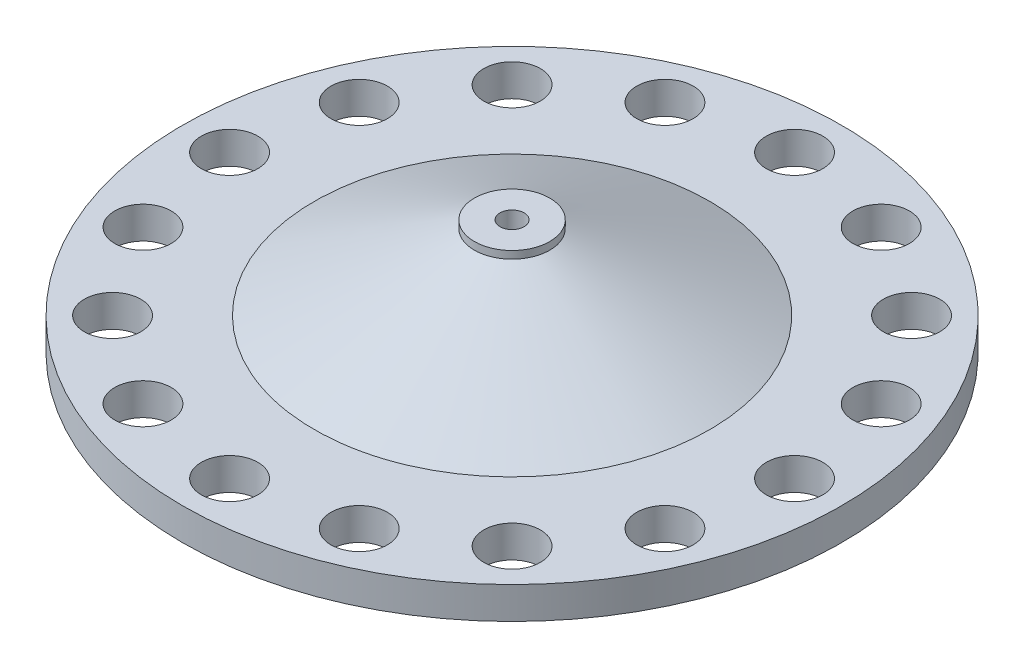
ISO-10303-21;
HEADER;
FILE_DESCRIPTION(('STEP AP214'),'2;1');
FILE_NAME('part.step','',(''),(''),'','','');
FILE_SCHEMA(('AUTOMOTIVE_DESIGN { 1 0 10303 214 1 1 1 1 }'));
ENDSEC;
DATA;
#1=APPLICATION_CONTEXT('core data for automotive mechanical design processes');
#2=APPLICATION_PROTOCOL_DEFINITION('international standard','automotive_design',2000,#1);
#3=PRODUCT_CONTEXT('',#1,'mechanical');
#4=PRODUCT('Part','Part','',(#3));
#5=PRODUCT_RELATED_PRODUCT_CATEGORY('part','',(#4));
#6=PRODUCT_DEFINITION_FORMATION('','',#4);
#7=PRODUCT_DEFINITION_CONTEXT('part definition',#1,'design');
#8=PRODUCT_DEFINITION('design','',#6,#7);
#9=PRODUCT_DEFINITION_SHAPE('','',#8);
#10=(LENGTH_UNIT() NAMED_UNIT(*) SI_UNIT(.MILLI.,.METRE.));
#11=(NAMED_UNIT(*) PLANE_ANGLE_UNIT() SI_UNIT($,.RADIAN.));
#12=(NAMED_UNIT(*) SI_UNIT($,.STERADIAN.) SOLID_ANGLE_UNIT());
#13=UNCERTAINTY_MEASURE_WITH_UNIT(LENGTH_MEASURE(1.E-05),#10,'distance_accuracy_value','');
#14=(GEOMETRIC_REPRESENTATION_CONTEXT(3) GLOBAL_UNCERTAINTY_ASSIGNED_CONTEXT((#13)) GLOBAL_UNIT_ASSIGNED_CONTEXT((#10,
#11,#12)) REPRESENTATION_CONTEXT('',''));
#15=CARTESIAN_POINT('',(0.,0.,0.));
#16=DIRECTION('',(0.,0.,1.));
#17=DIRECTION('',(1.,0.,0.));
#18=AXIS2_PLACEMENT_3D('',#15,#16,#17);
#19=CARTESIAN_POINT('',(0.,17.,0.));
#20=DIRECTION('',(0.,1.,0.));
#21=DIRECTION('',(0.,0.,1.));
#22=AXIS2_PLACEMENT_3D('',#19,#20,#21);
#23=PLANE('',#22);
#24=CARTESIAN_POINT('',(-138.581929876694,17.,57.4025148547616));
#25=DIRECTION('',(0.,1.,0.));
#26=DIRECTION('',(0.,0.,1.));
#27=AXIS2_PLACEMENT_3D('',#24,#25,#26);
#28=CIRCLE('',#27,15.);
#29=CARTESIAN_POINT('',(-138.581929876694,17.,72.4025148547616));
#30=VERTEX_POINT('',#29);
#31=EDGE_CURVE('E168',#30,#30,#28,.T.);
#32=ORIENTED_EDGE('',*,*,#31,.F.);
#33=EDGE_LOOP('',(#32));
#34=FACE_BOUND('',#33,.T.);
#35=CARTESIAN_POINT('',(-106.066017177983,17.,106.066017177981));
#36=DIRECTION('',(0.,1.,0.));
#37=DIRECTION('',(0.,0.,1.));
#38=AXIS2_PLACEMENT_3D('',#35,#36,#37);
#39=CIRCLE('',#38,15.);
#40=CARTESIAN_POINT('',(-106.066017177983,17.,121.066017177981));
#41=VERTEX_POINT('',#40);
#42=EDGE_CURVE('E175',#41,#41,#39,.T.);
#43=ORIENTED_EDGE('',*,*,#42,.F.);
#44=EDGE_LOOP('',(#43));
#45=FACE_BOUND('',#44,.T.);
#46=CARTESIAN_POINT('',(-57.402514854765,17.,138.581929876692));
#47=DIRECTION('',(0.,1.,0.));
#48=DIRECTION('',(0.,0.,1.));
#49=AXIS2_PLACEMENT_3D('',#46,#47,#48);
#50=CIRCLE('',#49,15.);
#51=CARTESIAN_POINT('',(-57.402514854765,17.,153.581929876692));
#52=VERTEX_POINT('',#51);
#53=EDGE_CURVE('E181',#52,#52,#50,.T.);
#54=ORIENTED_EDGE('',*,*,#53,.F.);
#55=EDGE_LOOP('',(#54));
#56=FACE_BOUND('',#55,.T.);
#57=CARTESIAN_POINT('',(-1.57116660247941E-12,17.,150.));
#58=DIRECTION('',(0.,1.,0.));
#59=DIRECTION('',(0.,0.,1.));
#60=AXIS2_PLACEMENT_3D('',#57,#58,#59);
#61=CIRCLE('',#60,15.);
#62=CARTESIAN_POINT('',(-1.57116660247941E-12,17.,165.));
#63=VERTEX_POINT('',#62);
#64=EDGE_CURVE('E187',#63,#63,#61,.T.);
#65=ORIENTED_EDGE('',*,*,#64,.F.);
#66=EDGE_LOOP('',(#65));
#67=FACE_BOUND('',#66,.T.);
#68=CARTESIAN_POINT('',(57.4025148547621,17.,138.581929876694));
#69=DIRECTION('',(0.,1.,0.));
#70=DIRECTION('',(0.,0.,1.));
#71=AXIS2_PLACEMENT_3D('',#68,#69,#70);
#72=CIRCLE('',#71,15.);
#73=CARTESIAN_POINT('',(57.4025148547621,17.,153.581929876694));
#74=VERTEX_POINT('',#73);
#75=EDGE_CURVE('E193',#74,#74,#72,.T.);
#76=ORIENTED_EDGE('',*,*,#75,.F.);
#77=EDGE_LOOP('',(#76));
#78=FACE_BOUND('',#77,.T.);
#79=CARTESIAN_POINT('',(106.066017177981,17.,106.066017177983));
#80=DIRECTION('',(0.,1.,0.));
#81=DIRECTION('',(0.,0.,1.));
#82=AXIS2_PLACEMENT_3D('',#79,#80,#81);
#83=CIRCLE('',#82,15.);
#84=CARTESIAN_POINT('',(106.066017177981,17.,121.066017177983));
#85=VERTEX_POINT('',#84);
#86=EDGE_CURVE('E199',#85,#85,#83,.T.);
#87=ORIENTED_EDGE('',*,*,#86,.F.);
#88=EDGE_LOOP('',(#87));
#89=FACE_BOUND('',#88,.T.);
#90=CARTESIAN_POINT('',(138.581929876692,17.,57.4025148547645));
#91=DIRECTION('',(0.,1.,0.));
#92=DIRECTION('',(0.,0.,1.));
#93=AXIS2_PLACEMENT_3D('',#90,#91,#92);
#94=CIRCLE('',#93,15.);
#95=CARTESIAN_POINT('',(138.581929876692,17.,72.4025148547646));
#96=VERTEX_POINT('',#95);
#97=EDGE_CURVE('E205',#96,#96,#94,.T.);
#98=ORIENTED_EDGE('',*,*,#97,.F.);
#99=EDGE_LOOP('',(#98));
#100=FACE_BOUND('',#99,.T.);
#101=CARTESIAN_POINT('',(150.,17.,1.04744440165294E-12));
#102=DIRECTION('',(0.,1.,0.));
#103=DIRECTION('',(0.,0.,1.));
#104=AXIS2_PLACEMENT_3D('',#101,#102,#103);
#105=CIRCLE('',#104,15.);
#106=CARTESIAN_POINT('',(150.,17.,15.0000000000011));
#107=VERTEX_POINT('',#106);
#108=EDGE_CURVE('E211',#107,#107,#105,.T.);
#109=ORIENTED_EDGE('',*,*,#108,.F.);
#110=EDGE_LOOP('',(#109));
#111=FACE_BOUND('',#110,.T.);
#112=CARTESIAN_POINT('',(138.581929876693,17.,-57.4025148547626));
#113=DIRECTION('',(0.,1.,0.));
#114=DIRECTION('',(0.,0.,1.));
#115=AXIS2_PLACEMENT_3D('',#112,#113,#114);
#116=CIRCLE('',#115,15.);
#117=CARTESIAN_POINT('',(138.581929876693,17.,-42.4025148547626));
#118=VERTEX_POINT('',#117);
#119=EDGE_CURVE('E217',#118,#118,#116,.T.);
#120=ORIENTED_EDGE('',*,*,#119,.F.);
#121=EDGE_LOOP('',(#120));
#122=FACE_BOUND('',#121,.T.);
#123=CARTESIAN_POINT('',(106.066017177983,17.,-106.066017177982));
#124=DIRECTION('',(0.,1.,0.));
#125=DIRECTION('',(0.,0.,1.));
#126=AXIS2_PLACEMENT_3D('',#123,#124,#125);
#127=CIRCLE('',#126,15.);
#128=CARTESIAN_POINT('',(106.066017177983,17.,-91.0660171779815));
#129=VERTEX_POINT('',#128);
#130=EDGE_CURVE('E223',#129,#129,#127,.T.);
#131=ORIENTED_EDGE('',*,*,#130,.F.);
#132=EDGE_LOOP('',(#131));
#133=FACE_BOUND('',#132,.T.);
#134=CARTESIAN_POINT('',(57.4025148547641,17.,-138.581929876693));
#135=DIRECTION('',(0.,1.,0.));
#136=DIRECTION('',(0.,0.,1.));
#137=AXIS2_PLACEMENT_3D('',#134,#135,#136);
#138=CIRCLE('',#137,15.);
#139=CARTESIAN_POINT('',(57.4025148547641,17.,-123.581929876693));
#140=VERTEX_POINT('',#139);
#141=EDGE_CURVE('E229',#140,#140,#138,.T.);
#142=ORIENTED_EDGE('',*,*,#141,.F.);
#143=EDGE_LOOP('',(#142));
#144=FACE_BOUND('',#143,.T.);
#145=CARTESIAN_POINT('',(5.2372220082647E-13,17.,-150.));
#146=DIRECTION('',(0.,1.,0.));
#147=DIRECTION('',(0.,0.,1.));
#148=AXIS2_PLACEMENT_3D('',#145,#146,#147);
#149=CIRCLE('',#148,15.);
#150=CARTESIAN_POINT('',(5.2372220082647E-13,17.,-135.));
#151=VERTEX_POINT('',#150);
#152=EDGE_CURVE('E235',#151,#151,#149,.T.);
#153=ORIENTED_EDGE('',*,*,#152,.F.);
#154=EDGE_LOOP('',(#153));
#155=FACE_BOUND('',#154,.T.);
#156=CARTESIAN_POINT('',(-57.4025148547631,17.,-138.581929876693));
#157=DIRECTION('',(0.,1.,0.));
#158=DIRECTION('',(0.,0.,1.));
#159=AXIS2_PLACEMENT_3D('',#156,#157,#158);
#160=CIRCLE('',#159,15.);
#161=CARTESIAN_POINT('',(-57.4025148547631,17.,-123.581929876693));
#162=VERTEX_POINT('',#161);
#163=EDGE_CURVE('E241',#162,#162,#160,.T.);
#164=ORIENTED_EDGE('',*,*,#163,.F.);
#165=EDGE_LOOP('',(#164));
#166=FACE_BOUND('',#165,.T.);
#167=CARTESIAN_POINT('',(-106.066017177982,17.,-106.066017177982));
#168=DIRECTION('',(0.,1.,0.));
#169=DIRECTION('',(0.,0.,1.));
#170=AXIS2_PLACEMENT_3D('',#167,#168,#169);
#171=CIRCLE('',#170,15.);
#172=CARTESIAN_POINT('',(-106.066017177982,17.,-91.0660171779823));
#173=VERTEX_POINT('',#172);
#174=EDGE_CURVE('E247',#173,#173,#171,.T.);
#175=ORIENTED_EDGE('',*,*,#174,.F.);
#176=EDGE_LOOP('',(#175));
#177=FACE_BOUND('',#176,.T.);
#178=CARTESIAN_POINT('',(-150.,17.,0.));
#179=DIRECTION('',(0.,1.,0.));
#180=DIRECTION('',(0.,0.,1.));
#181=AXIS2_PLACEMENT_3D('',#178,#179,#180);
#182=CIRCLE('',#181,15.);
#183=CARTESIAN_POINT('',(-150.,17.,15.));
#184=VERTEX_POINT('',#183);
#185=EDGE_CURVE('E253',#184,#184,#182,.T.);
#186=ORIENTED_EDGE('',*,*,#185,.F.);
#187=EDGE_LOOP('',(#186));
#188=FACE_BOUND('',#187,.T.);
#189=CARTESIAN_POINT('',(-138.581929876693,17.,-57.4025148547636));
#190=DIRECTION('',(0.,1.,0.));
#191=DIRECTION('',(0.,0.,1.));
#192=AXIS2_PLACEMENT_3D('',#189,#190,#191);
#193=CIRCLE('',#192,15.);
#194=CARTESIAN_POINT('',(-138.581929876693,17.,-42.4025148547636));
#195=VERTEX_POINT('',#194);
#196=EDGE_CURVE('E161',#195,#195,#193,.T.);
#197=ORIENTED_EDGE('',*,*,#196,.F.);
#198=EDGE_LOOP('',(#197));
#199=FACE_BOUND('',#198,.T.);
#200=CARTESIAN_POINT('',(0.,17.,0.));
#201=DIRECTION('',(0.,1.,0.));
#202=DIRECTION('',(0.,0.,1.));
#203=AXIS2_PLACEMENT_3D('',#200,#201,#202);
#204=CIRCLE('',#203,175.);
#205=CARTESIAN_POINT('',(0.,17.,175.));
#206=VERTEX_POINT('',#205);
#207=EDGE_CURVE('E11',#206,#206,#204,.T.);
#208=ORIENTED_EDGE('',*,*,#207,.T.);
#209=EDGE_LOOP('',(#208));
#210=FACE_BOUND('',#209,.T.);
#211=CARTESIAN_POINT('',(0.,17.,0.));
#212=DIRECTION('',(0.,1.,0.));
#213=DIRECTION('',(0.,0.,1.));
#214=AXIS2_PLACEMENT_3D('',#211,#212,#213);
#215=CIRCLE('',#214,105.);
#216=CARTESIAN_POINT('',(0.659730116383662,17.,-104.997927389894));
#217=VERTEX_POINT('',#216);
#218=EDGE_CURVE('E50',#217,#217,#215,.T.);
#219=ORIENTED_EDGE('',*,*,#218,.F.);
#220=EDGE_LOOP('',(#219));
#221=FACE_BOUND('',#220,.T.);
#222=ADVANCED_FACE('F36',(#34,#45,#56,#67,#78,#89,#100,#111,#122,#133,#144,#155,#166,#177,#188,
#199,#210,#221),#23,.T.);
#223=CARTESIAN_POINT('',(0.,17.,0.));
#224=DIRECTION('',(0.,-1.,0.));
#225=DIRECTION('',(0.,0.,-1.));
#226=AXIS2_PLACEMENT_3D('',#223,#224,#225);
#227=CYLINDRICAL_SURFACE('',#226,175.);
#228=ORIENTED_EDGE('',*,*,#207,.F.);
#229=EDGE_LOOP('',(#228));
#230=FACE_BOUND('',#229,.T.);
#231=CARTESIAN_POINT('',(0.,0.,0.));
#232=DIRECTION('',(0.,1.,0.));
#233=DIRECTION('',(0.,0.,1.));
#234=AXIS2_PLACEMENT_3D('',#231,#232,#233);
#235=CIRCLE('',#234,175.);
#236=CARTESIAN_POINT('',(0.,0.,175.));
#237=VERTEX_POINT('',#236);
#238=EDGE_CURVE('E45',#237,#237,#235,.T.);
#239=ORIENTED_EDGE('',*,*,#238,.T.);
#240=EDGE_LOOP('',(#239));
#241=FACE_BOUND('',#240,.T.);
#242=ADVANCED_FACE('F38',(#230,#241),#227,.T.);
#243=CARTESIAN_POINT('',(0.,0.,0.));
#244=DIRECTION('',(0.,1.,0.));
#245=DIRECTION('',(0.,0.,1.));
#246=AXIS2_PLACEMENT_3D('',#243,#244,#245);
#247=PLANE('',#246);
#248=CARTESIAN_POINT('',(0.,0.,0.));
#249=DIRECTION('',(0.,1.,0.));
#250=DIRECTION('',(0.,0.,1.));
#251=AXIS2_PLACEMENT_3D('',#248,#249,#250);
#252=CIRCLE('',#251,6.4);
#253=CARTESIAN_POINT('',(0.,0.,6.4));
#254=VERTEX_POINT('',#253);
#255=EDGE_CURVE('E260',#254,#254,#252,.T.);
#256=ORIENTED_EDGE('',*,*,#255,.T.);
#257=EDGE_LOOP('',(#256));
#258=FACE_BOUND('',#257,.T.);
#259=CARTESIAN_POINT('',(-138.581929876694,0.,57.4025148547616));
#260=DIRECTION('',(0.,1.,0.));
#261=DIRECTION('',(0.,0.,1.));
#262=AXIS2_PLACEMENT_3D('',#259,#260,#261);
#263=CIRCLE('',#262,15.);
#264=CARTESIAN_POINT('',(-138.581929876694,0.,72.4025148547616));
#265=VERTEX_POINT('',#264);
#266=EDGE_CURVE('E171',#265,#265,#263,.T.);
#267=ORIENTED_EDGE('',*,*,#266,.T.);
#268=EDGE_LOOP('',(#267));
#269=FACE_BOUND('',#268,.T.);
#270=CARTESIAN_POINT('',(-106.066017177983,0.,106.066017177981));
#271=DIRECTION('',(0.,1.,0.));
#272=DIRECTION('',(0.,0.,1.));
#273=AXIS2_PLACEMENT_3D('',#270,#271,#272);
#274=CIRCLE('',#273,15.);
#275=CARTESIAN_POINT('',(-106.066017177983,0.,121.066017177981));
#276=VERTEX_POINT('',#275);
#277=EDGE_CURVE('E178',#276,#276,#274,.T.);
#278=ORIENTED_EDGE('',*,*,#277,.T.);
#279=EDGE_LOOP('',(#278));
#280=FACE_BOUND('',#279,.T.);
#281=CARTESIAN_POINT('',(-57.402514854765,0.,138.581929876692));
#282=DIRECTION('',(0.,1.,0.));
#283=DIRECTION('',(0.,0.,1.));
#284=AXIS2_PLACEMENT_3D('',#281,#282,#283);
#285=CIRCLE('',#284,15.);
#286=CARTESIAN_POINT('',(-57.402514854765,0.,153.581929876692));
#287=VERTEX_POINT('',#286);
#288=EDGE_CURVE('E184',#287,#287,#285,.T.);
#289=ORIENTED_EDGE('',*,*,#288,.T.);
#290=EDGE_LOOP('',(#289));
#291=FACE_BOUND('',#290,.T.);
#292=CARTESIAN_POINT('',(-1.57116660247941E-12,0.,150.));
#293=DIRECTION('',(0.,1.,0.));
#294=DIRECTION('',(0.,0.,1.));
#295=AXIS2_PLACEMENT_3D('',#292,#293,#294);
#296=CIRCLE('',#295,15.);
#297=CARTESIAN_POINT('',(-1.57116660247941E-12,0.,165.));
#298=VERTEX_POINT('',#297);
#299=EDGE_CURVE('E190',#298,#298,#296,.T.);
#300=ORIENTED_EDGE('',*,*,#299,.T.);
#301=EDGE_LOOP('',(#300));
#302=FACE_BOUND('',#301,.T.);
#303=CARTESIAN_POINT('',(57.4025148547621,0.,138.581929876694));
#304=DIRECTION('',(0.,1.,0.));
#305=DIRECTION('',(0.,0.,1.));
#306=AXIS2_PLACEMENT_3D('',#303,#304,#305);
#307=CIRCLE('',#306,15.);
#308=CARTESIAN_POINT('',(57.4025148547621,0.,153.581929876694));
#309=VERTEX_POINT('',#308);
#310=EDGE_CURVE('E196',#309,#309,#307,.T.);
#311=ORIENTED_EDGE('',*,*,#310,.T.);
#312=EDGE_LOOP('',(#311));
#313=FACE_BOUND('',#312,.T.);
#314=CARTESIAN_POINT('',(106.066017177981,0.,106.066017177983));
#315=DIRECTION('',(0.,1.,0.));
#316=DIRECTION('',(0.,0.,1.));
#317=AXIS2_PLACEMENT_3D('',#314,#315,#316);
#318=CIRCLE('',#317,15.);
#319=CARTESIAN_POINT('',(106.066017177981,0.,121.066017177983));
#320=VERTEX_POINT('',#319);
#321=EDGE_CURVE('E202',#320,#320,#318,.T.);
#322=ORIENTED_EDGE('',*,*,#321,.T.);
#323=EDGE_LOOP('',(#322));
#324=FACE_BOUND('',#323,.T.);
#325=CARTESIAN_POINT('',(138.581929876692,0.,57.4025148547645));
#326=DIRECTION('',(0.,1.,0.));
#327=DIRECTION('',(0.,0.,1.));
#328=AXIS2_PLACEMENT_3D('',#325,#326,#327);
#329=CIRCLE('',#328,15.);
#330=CARTESIAN_POINT('',(138.581929876692,0.,72.4025148547646));
#331=VERTEX_POINT('',#330);
#332=EDGE_CURVE('E208',#331,#331,#329,.T.);
#333=ORIENTED_EDGE('',*,*,#332,.T.);
#334=EDGE_LOOP('',(#333));
#335=FACE_BOUND('',#334,.T.);
#336=CARTESIAN_POINT('',(150.,0.,1.04744440165294E-12));
#337=DIRECTION('',(0.,1.,0.));
#338=DIRECTION('',(0.,0.,1.));
#339=AXIS2_PLACEMENT_3D('',#336,#337,#338);
#340=CIRCLE('',#339,15.);
#341=CARTESIAN_POINT('',(150.,0.,15.0000000000011));
#342=VERTEX_POINT('',#341);
#343=EDGE_CURVE('E214',#342,#342,#340,.T.);
#344=ORIENTED_EDGE('',*,*,#343,.T.);
#345=EDGE_LOOP('',(#344));
#346=FACE_BOUND('',#345,.T.);
#347=CARTESIAN_POINT('',(138.581929876693,0.,-57.4025148547626));
#348=DIRECTION('',(0.,1.,0.));
#349=DIRECTION('',(0.,0.,1.));
#350=AXIS2_PLACEMENT_3D('',#347,#348,#349);
#351=CIRCLE('',#350,15.);
#352=CARTESIAN_POINT('',(138.581929876693,0.,-42.4025148547626));
#353=VERTEX_POINT('',#352);
#354=EDGE_CURVE('E220',#353,#353,#351,.T.);
#355=ORIENTED_EDGE('',*,*,#354,.T.);
#356=EDGE_LOOP('',(#355));
#357=FACE_BOUND('',#356,.T.);
#358=CARTESIAN_POINT('',(106.066017177983,0.,-106.066017177982));
#359=DIRECTION('',(0.,1.,0.));
#360=DIRECTION('',(0.,0.,1.));
#361=AXIS2_PLACEMENT_3D('',#358,#359,#360);
#362=CIRCLE('',#361,15.);
#363=CARTESIAN_POINT('',(106.066017177983,0.,-91.0660171779815));
#364=VERTEX_POINT('',#363);
#365=EDGE_CURVE('E226',#364,#364,#362,.T.);
#366=ORIENTED_EDGE('',*,*,#365,.T.);
#367=EDGE_LOOP('',(#366));
#368=FACE_BOUND('',#367,.T.);
#369=CARTESIAN_POINT('',(57.4025148547641,0.,-138.581929876693));
#370=DIRECTION('',(0.,1.,0.));
#371=DIRECTION('',(0.,0.,1.));
#372=AXIS2_PLACEMENT_3D('',#369,#370,#371);
#373=CIRCLE('',#372,15.);
#374=CARTESIAN_POINT('',(57.4025148547641,0.,-123.581929876693));
#375=VERTEX_POINT('',#374);
#376=EDGE_CURVE('E232',#375,#375,#373,.T.);
#377=ORIENTED_EDGE('',*,*,#376,.T.);
#378=EDGE_LOOP('',(#377));
#379=FACE_BOUND('',#378,.T.);
#380=CARTESIAN_POINT('',(5.2372220082647E-13,0.,-150.));
#381=DIRECTION('',(0.,1.,0.));
#382=DIRECTION('',(0.,0.,1.));
#383=AXIS2_PLACEMENT_3D('',#380,#381,#382);
#384=CIRCLE('',#383,15.);
#385=CARTESIAN_POINT('',(5.2372220082647E-13,0.,-135.));
#386=VERTEX_POINT('',#385);
#387=EDGE_CURVE('E238',#386,#386,#384,.T.);
#388=ORIENTED_EDGE('',*,*,#387,.T.);
#389=EDGE_LOOP('',(#388));
#390=FACE_BOUND('',#389,.T.);
#391=CARTESIAN_POINT('',(-57.4025148547631,0.,-138.581929876693));
#392=DIRECTION('',(0.,1.,0.));
#393=DIRECTION('',(0.,0.,1.));
#394=AXIS2_PLACEMENT_3D('',#391,#392,#393);
#395=CIRCLE('',#394,15.);
#396=CARTESIAN_POINT('',(-57.4025148547631,0.,-123.581929876693));
#397=VERTEX_POINT('',#396);
#398=EDGE_CURVE('E244',#397,#397,#395,.T.);
#399=ORIENTED_EDGE('',*,*,#398,.T.);
#400=EDGE_LOOP('',(#399));
#401=FACE_BOUND('',#400,.T.);
#402=CARTESIAN_POINT('',(-106.066017177982,0.,-106.066017177982));
#403=DIRECTION('',(0.,1.,0.));
#404=DIRECTION('',(0.,0.,1.));
#405=AXIS2_PLACEMENT_3D('',#402,#403,#404);
#406=CIRCLE('',#405,15.);
#407=CARTESIAN_POINT('',(-106.066017177982,0.,-91.0660171779823));
#408=VERTEX_POINT('',#407);
#409=EDGE_CURVE('E250',#408,#408,#406,.T.);
#410=ORIENTED_EDGE('',*,*,#409,.T.);
#411=EDGE_LOOP('',(#410));
#412=FACE_BOUND('',#411,.T.);
#413=CARTESIAN_POINT('',(-150.,0.,0.));
#414=DIRECTION('',(0.,1.,0.));
#415=DIRECTION('',(0.,0.,1.));
#416=AXIS2_PLACEMENT_3D('',#413,#414,#415);
#417=CIRCLE('',#416,15.);
#418=CARTESIAN_POINT('',(-150.,0.,15.));
#419=VERTEX_POINT('',#418);
#420=EDGE_CURVE('E165',#419,#419,#417,.T.);
#421=ORIENTED_EDGE('',*,*,#420,.T.);
#422=EDGE_LOOP('',(#421));
#423=FACE_BOUND('',#422,.T.);
#424=CARTESIAN_POINT('',(-138.581929876693,0.,-57.4025148547636));
#425=DIRECTION('',(0.,1.,0.));
#426=DIRECTION('',(0.,0.,1.));
#427=AXIS2_PLACEMENT_3D('',#424,#425,#426);
#428=CIRCLE('',#427,15.);
#429=CARTESIAN_POINT('',(-138.581929876693,0.,-42.4025148547636));
#430=VERTEX_POINT('',#429);
#431=EDGE_CURVE('E164',#430,#430,#428,.T.);
#432=ORIENTED_EDGE('',*,*,#431,.T.);
#433=EDGE_LOOP('',(#432));
#434=FACE_BOUND('',#433,.T.);
#435=ORIENTED_EDGE('',*,*,#238,.F.);
#436=EDGE_LOOP('',(#435));
#437=FACE_BOUND('',#436,.T.);
#438=ADVANCED_FACE('F143',(#258,#269,#280,#291,#302,#313,#324,#335,#346,#357,#368,#379,#390,
#401,#412,#423,#434,#437),#247,.F.);
#439=CARTESIAN_POINT('',(4.6422581431802,57.,-19.4537769939947));
#440=CARTESIAN_POINT('',(0.659730116383662,17.,-104.997927389894));
#441=CARTESIAN_POINT('',(43.5498121311696,57.,-10.1692607076343));
#442=CARTESIAN_POINT('',(210.655584896172,17.,-103.678467157127));
#443=CARTESIAN_POINT('',(34.2652958448092,57.,28.7382932803551));
#444=CARTESIAN_POINT('',(209.336124663405,17.,106.317387622662));
#445=CARTESIAN_POINT('',(-4.6422581431802,57.,19.4537769939947));
#446=CARTESIAN_POINT('',(-0.659730116383675,17.,104.997927389894));
#447=CARTESIAN_POINT('',(-43.5498121311696,57.,10.1692607076343));
#448=CARTESIAN_POINT('',(-210.655584896172,17.,103.678467157127));
#449=CARTESIAN_POINT('',(-34.2652958448092,57.,-28.7382932803551));
#450=CARTESIAN_POINT('',(-209.336124663405,17.,-106.317387622662));
#451=CARTESIAN_POINT('',(4.6422581431802,57.,-19.4537769939947));
#452=CARTESIAN_POINT('',(0.659730116383662,17.,-104.997927389894));
#453=(BOUNDED_SURFACE() B_SPLINE_SURFACE(3,1,((#439,#440),(#441,#442),(#443,#444),(#445,#446),
(#447,#448),(#449,#450),(#451,#452)),.UNSPECIFIED.,.T.,.F.,.F.) B_SPLINE_SURFACE_WITH_KNOTS((4,
3,4),(2,2),(0.,0.5,1.),(0.,1.),
.UNSPECIFIED.) GEOMETRIC_REPRESENTATION_ITEM() RATIONAL_B_SPLINE_SURFACE(((1.,1.),
(0.333333333333333,0.333333333333333),(0.333333333333333,0.333333333333333),(1.,1.),
(0.333333333333333,0.333333333333333),(0.333333333333333,0.333333333333333),(1.,1.))) REPRESENTATION_ITEM('') SURFACE());
#454=CARTESIAN_POINT('',(0.,57.,0.));
#455=DIRECTION('',(0.,1.,0.));
#456=DIRECTION('',(0.,0.,1.));
#457=AXIS2_PLACEMENT_3D('',#454,#455,#456);
#458=CIRCLE('',#457,20.);
#459=CARTESIAN_POINT('',(4.6422581431802,57.,-19.4537769939947));
#460=VERTEX_POINT('',#459);
#461=EDGE_CURVE('E40',#460,#460,#458,.T.);
#462=CARTESIAN_POINT('',(4.6422581431802,57.,-19.4537769939947));
#463=CARTESIAN_POINT('',(4.6007734762344,56.5833333333333,-20.344861893952));
#464=CARTESIAN_POINT('',(4.5592888092886,56.1666666666667,-21.2359467939093));
#465=CARTESIAN_POINT('',(4.47631947539701,55.3333333333333,-23.0181165938238));
#466=CARTESIAN_POINT('',(4.43483480845121,54.9166666666667,-23.9092014937811));
#467=CARTESIAN_POINT('',(4.35186547455962,54.0833333333333,-25.6913712936957));
#468=CARTESIAN_POINT('',(4.31038080761382,53.6666666666667,-26.582456193653));
#469=CARTESIAN_POINT('',(4.22741147372223,52.8333333333333,-28.3646259935676));
#470=CARTESIAN_POINT('',(4.18592680677643,52.4166666666667,-29.2557108935249));
#471=CARTESIAN_POINT('',(4.10295747288483,51.5833333333333,-31.0378806934394));
#472=CARTESIAN_POINT('',(4.06147280593904,51.1666666666667,-31.9289655933967));
#473=CARTESIAN_POINT('',(3.97850347204744,50.3333333333333,-33.7111353933113));
#474=CARTESIAN_POINT('',(3.93701880510165,49.9166666666667,-34.6022202932686));
#475=CARTESIAN_POINT('',(3.85404947121005,49.0833333333333,-36.3843900931832));
#476=CARTESIAN_POINT('',(3.81256480426425,48.6666666666667,-37.2754749931405));
#477=CARTESIAN_POINT('',(3.72959547037266,47.8333333333333,-39.057644793055));
#478=CARTESIAN_POINT('',(3.68811080342686,47.4166666666667,-39.9487296930123));
#479=CARTESIAN_POINT('',(3.60514146953527,46.5833333333333,-41.7308994929269));
#480=CARTESIAN_POINT('',(3.56365680258947,46.1666666666667,-42.6219843928842));
#481=CARTESIAN_POINT('',(3.48068746869788,45.3333333333333,-44.4041541927988));
#482=CARTESIAN_POINT('',(3.43920280175208,44.9166666666667,-45.2952390927561));
#483=CARTESIAN_POINT('',(3.35623346786048,44.0833333333333,-47.0774088926706));
#484=CARTESIAN_POINT('',(3.31474880091469,43.6666666666667,-47.9684937926279));
#485=CARTESIAN_POINT('',(3.23177946702309,42.8333333333333,-49.7506635925425));
#486=CARTESIAN_POINT('',(3.19029480007729,42.4166666666667,-50.6417484924998));
#487=CARTESIAN_POINT('',(3.1073254661857,41.5833333333333,-52.4239182924144));
#488=CARTESIAN_POINT('',(3.0658407992399,41.1666666666667,-53.3150031923717));
#489=CARTESIAN_POINT('',(2.98287146534831,40.3333333333333,-55.0971729922862));
#490=CARTESIAN_POINT('',(2.94138679840251,39.9166666666667,-55.9882578922435));
#491=CARTESIAN_POINT('',(2.85841746451092,39.0833333333333,-57.7704276921581));
#492=CARTESIAN_POINT('',(2.81693279756512,38.6666666666667,-58.6615125921154));
#493=CARTESIAN_POINT('',(2.73396346367353,37.8333333333333,-60.44368239203));
#494=CARTESIAN_POINT('',(2.69247879672773,37.4166666666667,-61.3347672919873));
#495=CARTESIAN_POINT('',(2.60950946283613,36.5833333333333,-63.1169370919018));
#496=CARTESIAN_POINT('',(2.56802479589034,36.1666666666667,-64.0080219918591));
#497=CARTESIAN_POINT('',(2.48505546199874,35.3333333333333,-65.7901917917737));
#498=CARTESIAN_POINT('',(2.44357079505294,34.9166666666667,-66.681276691731));
#499=CARTESIAN_POINT('',(2.36060146116135,34.0833333333333,-68.4634464916456));
#500=CARTESIAN_POINT('',(2.31911679421555,33.6666666666667,-69.3545313916028));
#501=CARTESIAN_POINT('',(2.23614746032396,32.8333333333333,-71.1367011915174));
#502=CARTESIAN_POINT('',(2.19466279337816,32.4166666666667,-72.0277860914747));
#503=CARTESIAN_POINT('',(2.11169345948657,31.5833333333333,-73.8099558913893));
#504=CARTESIAN_POINT('',(2.07020879254077,31.1666666666667,-74.7010407913466));
#505=CARTESIAN_POINT('',(1.98723945864917,30.3333333333333,-76.4832105912612));
#506=CARTESIAN_POINT('',(1.94575479170338,29.9166666666667,-77.3742954912184));
#507=CARTESIAN_POINT('',(1.86278545781178,29.0833333333333,-79.156465291133));
#508=CARTESIAN_POINT('',(1.82130079086599,28.6666666666667,-80.0475501910903));
#509=CARTESIAN_POINT('',(1.73833145697439,27.8333333333333,-81.8297199910049));
#510=CARTESIAN_POINT('',(1.69684679002859,27.4166666666667,-82.7208048909622));
#511=CARTESIAN_POINT('',(1.613877456137,26.5833333333333,-84.5029746908768));
#512=CARTESIAN_POINT('',(1.5723927891912,26.1666666666667,-85.394059590834));
#513=CARTESIAN_POINT('',(1.48942345529961,25.3333333333333,-87.1762293907486));
#514=CARTESIAN_POINT('',(1.44793878835381,24.9166666666667,-88.0673142907059));
#515=CARTESIAN_POINT('',(1.36496945446222,24.0833333333333,-89.8494840906205));
#516=CARTESIAN_POINT('',(1.32348478751642,23.6666666666667,-90.7405689905778));
#517=CARTESIAN_POINT('',(1.24051545362482,22.8333333333333,-92.5227387904924));
#518=CARTESIAN_POINT('',(1.19903078667903,22.4166666666667,-93.4138236904496));
#519=CARTESIAN_POINT('',(1.11606145278743,21.5833333333333,-95.1959934903642));
#520=CARTESIAN_POINT('',(1.07457678584163,21.1666666666667,-96.0870783903215));
#521=CARTESIAN_POINT('',(0.99160745195004,20.3333333333333,-97.8692481902361));
#522=CARTESIAN_POINT('',(0.950122785004242,19.9166666666667,-98.7603330901934));
#523=CARTESIAN_POINT('',(0.867153451112648,19.0833333333333,-100.542502890108));
#524=CARTESIAN_POINT('',(0.825668784166851,18.6666666666667,-101.433587790065));
#525=CARTESIAN_POINT('',(0.742699450275257,17.8333333333333,-103.21575758998));
#526=CARTESIAN_POINT('',(0.70121478332946,17.4166666666667,-104.106842489937));
#527=CARTESIAN_POINT('',(0.659730116383662,17.,-104.997927389894));
#528=B_SPLINE_CURVE_WITH_KNOTS('',3,(#462,#463,#464,#465,#466,#467,#468,#469,#470,#471,#472,
#473,#474,#475,#476,#477,#478,#479,#480,#481,#482,#483,#484,#485,#486,#487,#488,#489,#490,#491,
#492,#493,#494,#495,#496,#497,#498,#499,#500,#501,#502,#503,#504,#505,#506,#507,#508,#509,#510,
#511,#512,#513,#514,#515,#516,#517,#518,#519,#520,#521,#522,#523,#524,#525,#526,#527),
.UNSPECIFIED.,.F.,.F.,(4,2,2,2,2,2,2,2,2,2,2,2,2,2,2,2,2,2,2,2,2,2,2,2,2,2,2,2,2,2,2,2,4),(0.,
2.95368913203666,5.90737826407331,8.86106739610997,11.8147565281466,14.7684456601833,
17.7221347922199,20.6758239242566,23.6295130562932,26.5832021883299,29.5368913203666,
32.4905804524032,35.4442695844399,38.3979587164765,41.3516478485132,44.3053369805498,
47.2590261125865,50.2127152446232,53.1664043766598,56.1200935086965,59.0737826407331,
62.0274717727698,64.9811609048064,67.9348500368431,70.8885391688797,73.8422283009164,
76.795917432953,79.7496065649897,82.7032956970263,85.656984829063,88.6106739610996,
91.5643630931363,94.518052225173),.UNSPECIFIED.);
#529=EDGE_CURVE('BSEAM136',#460,#217,#528,.T.);
#530=ORIENTED_EDGE('',*,*,#461,.F.);
#531=ORIENTED_EDGE('',*,*,#218,.T.);
#532=ORIENTED_EDGE('',*,*,#529,.T.);
#533=ORIENTED_EDGE('',*,*,#529,.F.);
#534=EDGE_LOOP('',(#530,#532,#531,#533));
#535=FACE_BOUND('',#534,.T.);
#536=ADVANCED_FACE('F136',(#535),#453,.T.);
#537=CARTESIAN_POINT('',(-138.581929876693,0.,-57.4025148547636));
#538=DIRECTION('',(0.,1.,0.));
#539=DIRECTION('',(0.,0.,1.));
#540=AXIS2_PLACEMENT_3D('',#537,#538,#539);
#541=CYLINDRICAL_SURFACE('',#540,15.);
#542=ORIENTED_EDGE('',*,*,#431,.F.);
#543=EDGE_LOOP('',(#542));
#544=FACE_BOUND('',#543,.T.);
#545=ORIENTED_EDGE('',*,*,#196,.T.);
#546=EDGE_LOOP('',(#545));
#547=FACE_BOUND('',#546,.T.);
#548=ADVANCED_FACE('F78',(#544,#547),#541,.F.);
#549=CARTESIAN_POINT('',(-150.,0.,0.));
#550=DIRECTION('',(0.,1.,0.));
#551=DIRECTION('',(0.,0.,1.));
#552=AXIS2_PLACEMENT_3D('',#549,#550,#551);
#553=CYLINDRICAL_SURFACE('',#552,15.);
#554=ORIENTED_EDGE('',*,*,#420,.F.);
#555=EDGE_LOOP('',(#554));
#556=FACE_BOUND('',#555,.T.);
#557=ORIENTED_EDGE('',*,*,#185,.T.);
#558=EDGE_LOOP('',(#557));
#559=FACE_BOUND('',#558,.T.);
#560=ADVANCED_FACE('F74',(#556,#559),#553,.F.);
#561=CARTESIAN_POINT('',(-106.066017177982,0.,-106.066017177982));
#562=DIRECTION('',(0.,1.,0.));
#563=DIRECTION('',(0.,0.,1.));
#564=AXIS2_PLACEMENT_3D('',#561,#562,#563);
#565=CYLINDRICAL_SURFACE('',#564,15.);
#566=ORIENTED_EDGE('',*,*,#409,.F.);
#567=EDGE_LOOP('',(#566));
#568=FACE_BOUND('',#567,.T.);
#569=ORIENTED_EDGE('',*,*,#174,.T.);
#570=EDGE_LOOP('',(#569));
#571=FACE_BOUND('',#570,.T.);
#572=ADVANCED_FACE('F77',(#568,#571),#565,.F.);
#573=CARTESIAN_POINT('',(-57.4025148547631,0.,-138.581929876693));
#574=DIRECTION('',(0.,1.,0.));
#575=DIRECTION('',(0.,0.,1.));
#576=AXIS2_PLACEMENT_3D('',#573,#574,#575);
#577=CYLINDRICAL_SURFACE('',#576,15.);
#578=ORIENTED_EDGE('',*,*,#398,.F.);
#579=EDGE_LOOP('',(#578));
#580=FACE_BOUND('',#579,.T.);
#581=ORIENTED_EDGE('',*,*,#163,.T.);
#582=EDGE_LOOP('',(#581));
#583=FACE_BOUND('',#582,.T.);
#584=ADVANCED_FACE('F82',(#580,#583),#577,.F.);
#585=CARTESIAN_POINT('',(5.2372220082647E-13,0.,-150.));
#586=DIRECTION('',(0.,1.,0.));
#587=DIRECTION('',(0.,0.,1.));
#588=AXIS2_PLACEMENT_3D('',#585,#586,#587);
#589=CYLINDRICAL_SURFACE('',#588,15.);
#590=ORIENTED_EDGE('',*,*,#387,.F.);
#591=EDGE_LOOP('',(#590));
#592=FACE_BOUND('',#591,.T.);
#593=ORIENTED_EDGE('',*,*,#152,.T.);
#594=EDGE_LOOP('',(#593));
#595=FACE_BOUND('',#594,.T.);
#596=ADVANCED_FACE('F86',(#592,#595),#589,.F.);
#597=CARTESIAN_POINT('',(57.4025148547641,0.,-138.581929876693));
#598=DIRECTION('',(0.,1.,0.));
#599=DIRECTION('',(0.,0.,1.));
#600=AXIS2_PLACEMENT_3D('',#597,#598,#599);
#601=CYLINDRICAL_SURFACE('',#600,15.);
#602=ORIENTED_EDGE('',*,*,#376,.F.);
#603=EDGE_LOOP('',(#602));
#604=FACE_BOUND('',#603,.T.);
#605=ORIENTED_EDGE('',*,*,#141,.T.);
#606=EDGE_LOOP('',(#605));
#607=FACE_BOUND('',#606,.T.);
#608=ADVANCED_FACE('F90',(#604,#607),#601,.F.);
#609=CARTESIAN_POINT('',(106.066017177983,0.,-106.066017177982));
#610=DIRECTION('',(0.,1.,0.));
#611=DIRECTION('',(0.,0.,1.));
#612=AXIS2_PLACEMENT_3D('',#609,#610,#611);
#613=CYLINDRICAL_SURFACE('',#612,15.);
#614=ORIENTED_EDGE('',*,*,#365,.F.);
#615=EDGE_LOOP('',(#614));
#616=FACE_BOUND('',#615,.T.);
#617=ORIENTED_EDGE('',*,*,#130,.T.);
#618=EDGE_LOOP('',(#617));
#619=FACE_BOUND('',#618,.T.);
#620=ADVANCED_FACE('F94',(#616,#619),#613,.F.);
#621=CARTESIAN_POINT('',(138.581929876693,0.,-57.4025148547626));
#622=DIRECTION('',(0.,1.,0.));
#623=DIRECTION('',(0.,0.,1.));
#624=AXIS2_PLACEMENT_3D('',#621,#622,#623);
#625=CYLINDRICAL_SURFACE('',#624,15.);
#626=ORIENTED_EDGE('',*,*,#354,.F.);
#627=EDGE_LOOP('',(#626));
#628=FACE_BOUND('',#627,.T.);
#629=ORIENTED_EDGE('',*,*,#119,.T.);
#630=EDGE_LOOP('',(#629));
#631=FACE_BOUND('',#630,.T.);
#632=ADVANCED_FACE('F98',(#628,#631),#625,.F.);
#633=CARTESIAN_POINT('',(150.,0.,1.04744440165294E-12));
#634=DIRECTION('',(0.,1.,0.));
#635=DIRECTION('',(0.,0.,1.));
#636=AXIS2_PLACEMENT_3D('',#633,#634,#635);
#637=CYLINDRICAL_SURFACE('',#636,15.);
#638=ORIENTED_EDGE('',*,*,#343,.F.);
#639=EDGE_LOOP('',(#638));
#640=FACE_BOUND('',#639,.T.);
#641=ORIENTED_EDGE('',*,*,#108,.T.);
#642=EDGE_LOOP('',(#641));
#643=FACE_BOUND('',#642,.T.);
#644=ADVANCED_FACE('F102',(#640,#643),#637,.F.);
#645=CARTESIAN_POINT('',(138.581929876692,0.,57.4025148547645));
#646=DIRECTION('',(0.,1.,0.));
#647=DIRECTION('',(0.,0.,1.));
#648=AXIS2_PLACEMENT_3D('',#645,#646,#647);
#649=CYLINDRICAL_SURFACE('',#648,15.);
#650=ORIENTED_EDGE('',*,*,#332,.F.);
#651=EDGE_LOOP('',(#650));
#652=FACE_BOUND('',#651,.T.);
#653=ORIENTED_EDGE('',*,*,#97,.T.);
#654=EDGE_LOOP('',(#653));
#655=FACE_BOUND('',#654,.T.);
#656=ADVANCED_FACE('F106',(#652,#655),#649,.F.);
#657=CARTESIAN_POINT('',(106.066017177981,0.,106.066017177983));
#658=DIRECTION('',(0.,1.,0.));
#659=DIRECTION('',(0.,0.,1.));
#660=AXIS2_PLACEMENT_3D('',#657,#658,#659);
#661=CYLINDRICAL_SURFACE('',#660,15.);
#662=ORIENTED_EDGE('',*,*,#321,.F.);
#663=EDGE_LOOP('',(#662));
#664=FACE_BOUND('',#663,.T.);
#665=ORIENTED_EDGE('',*,*,#86,.T.);
#666=EDGE_LOOP('',(#665));
#667=FACE_BOUND('',#666,.T.);
#668=ADVANCED_FACE('F110',(#664,#667),#661,.F.);
#669=CARTESIAN_POINT('',(57.4025148547621,0.,138.581929876694));
#670=DIRECTION('',(0.,1.,0.));
#671=DIRECTION('',(0.,0.,1.));
#672=AXIS2_PLACEMENT_3D('',#669,#670,#671);
#673=CYLINDRICAL_SURFACE('',#672,15.);
#674=ORIENTED_EDGE('',*,*,#310,.F.);
#675=EDGE_LOOP('',(#674));
#676=FACE_BOUND('',#675,.T.);
#677=ORIENTED_EDGE('',*,*,#75,.T.);
#678=EDGE_LOOP('',(#677));
#679=FACE_BOUND('',#678,.T.);
#680=ADVANCED_FACE('F114',(#676,#679),#673,.F.);
#681=CARTESIAN_POINT('',(-1.57116660247941E-12,0.,150.));
#682=DIRECTION('',(0.,1.,0.));
#683=DIRECTION('',(0.,0.,1.));
#684=AXIS2_PLACEMENT_3D('',#681,#682,#683);
#685=CYLINDRICAL_SURFACE('',#684,15.);
#686=ORIENTED_EDGE('',*,*,#299,.F.);
#687=EDGE_LOOP('',(#686));
#688=FACE_BOUND('',#687,.T.);
#689=ORIENTED_EDGE('',*,*,#64,.T.);
#690=EDGE_LOOP('',(#689));
#691=FACE_BOUND('',#690,.T.);
#692=ADVANCED_FACE('F118',(#688,#691),#685,.F.);
#693=CARTESIAN_POINT('',(-57.402514854765,0.,138.581929876692));
#694=DIRECTION('',(0.,1.,0.));
#695=DIRECTION('',(0.,0.,1.));
#696=AXIS2_PLACEMENT_3D('',#693,#694,#695);
#697=CYLINDRICAL_SURFACE('',#696,15.);
#698=ORIENTED_EDGE('',*,*,#288,.F.);
#699=EDGE_LOOP('',(#698));
#700=FACE_BOUND('',#699,.T.);
#701=ORIENTED_EDGE('',*,*,#53,.T.);
#702=EDGE_LOOP('',(#701));
#703=FACE_BOUND('',#702,.T.);
#704=ADVANCED_FACE('F122',(#700,#703),#697,.F.);
#705=CARTESIAN_POINT('',(-106.066017177983,0.,106.066017177981));
#706=DIRECTION('',(0.,1.,0.));
#707=DIRECTION('',(0.,0.,1.));
#708=AXIS2_PLACEMENT_3D('',#705,#706,#707);
#709=CYLINDRICAL_SURFACE('',#708,15.);
#710=ORIENTED_EDGE('',*,*,#277,.F.);
#711=EDGE_LOOP('',(#710));
#712=FACE_BOUND('',#711,.T.);
#713=ORIENTED_EDGE('',*,*,#42,.T.);
#714=EDGE_LOOP('',(#713));
#715=FACE_BOUND('',#714,.T.);
#716=ADVANCED_FACE('F126',(#712,#715),#709,.F.);
#717=CARTESIAN_POINT('',(-138.581929876694,0.,57.4025148547616));
#718=DIRECTION('',(0.,1.,0.));
#719=DIRECTION('',(0.,0.,1.));
#720=AXIS2_PLACEMENT_3D('',#717,#718,#719);
#721=CYLINDRICAL_SURFACE('',#720,15.);
#722=ORIENTED_EDGE('',*,*,#266,.F.);
#723=EDGE_LOOP('',(#722));
#724=FACE_BOUND('',#723,.T.);
#725=ORIENTED_EDGE('',*,*,#31,.T.);
#726=EDGE_LOOP('',(#725));
#727=FACE_BOUND('',#726,.T.);
#728=ADVANCED_FACE('F71',(#724,#727),#721,.F.);
#729=CARTESIAN_POINT('',(0.,61.,0.));
#730=DIRECTION('',(0.,-1.,0.));
#731=DIRECTION('',(0.,0.,-1.));
#732=AXIS2_PLACEMENT_3D('',#729,#730,#731);
#733=CYLINDRICAL_SURFACE('',#732,20.);
#734=CARTESIAN_POINT('',(0.,61.,0.));
#735=DIRECTION('',(0.,1.,0.));
#736=DIRECTION('',(0.,0.,1.));
#737=AXIS2_PLACEMENT_3D('',#734,#735,#736);
#738=CIRCLE('',#737,20.);
#739=CARTESIAN_POINT('',(0.,61.,20.));
#740=VERTEX_POINT('',#739);
#741=EDGE_CURVE('E172',#740,#740,#738,.T.);
#742=ORIENTED_EDGE('',*,*,#741,.F.);
#743=EDGE_LOOP('',(#742));
#744=FACE_BOUND('',#743,.T.);
#745=ORIENTED_EDGE('',*,*,#461,.T.);
#746=EDGE_LOOP('',(#745));
#747=FACE_BOUND('',#746,.T.);
#748=ADVANCED_FACE('F60',(#744,#747),#733,.T.);
#749=CARTESIAN_POINT('',(0.,61.,0.));
#750=DIRECTION('',(0.,1.,0.));
#751=DIRECTION('',(0.,0.,1.));
#752=AXIS2_PLACEMENT_3D('',#749,#750,#751);
#753=PLANE('',#752);
#754=CARTESIAN_POINT('',(0.,61.,0.));
#755=DIRECTION('',(0.,1.,0.));
#756=DIRECTION('',(0.,0.,1.));
#757=AXIS2_PLACEMENT_3D('',#754,#755,#756);
#758=CIRCLE('',#757,6.4);
#759=CARTESIAN_POINT('',(0.,61.,6.4));
#760=VERTEX_POINT('',#759);
#761=EDGE_CURVE('E261',#760,#760,#758,.T.);
#762=ORIENTED_EDGE('',*,*,#761,.F.);
#763=EDGE_LOOP('',(#762));
#764=FACE_BOUND('',#763,.T.);
#765=ORIENTED_EDGE('',*,*,#741,.T.);
#766=EDGE_LOOP('',(#765));
#767=FACE_BOUND('',#766,.T.);
#768=ADVANCED_FACE('F70',(#764,#767),#753,.T.);
#769=CARTESIAN_POINT('',(0.,0.,0.));
#770=DIRECTION('',(0.,1.,0.));
#771=DIRECTION('',(0.,0.,1.));
#772=AXIS2_PLACEMENT_3D('',#769,#770,#771);
#773=CYLINDRICAL_SURFACE('',#772,6.4);
#774=CARTESIAN_POINT('',(0.,0.,6.4));
#775=CARTESIAN_POINT('',(0.,0.635416666666667,6.4));
#776=CARTESIAN_POINT('',(0.,1.27083333333333,6.4));
#777=CARTESIAN_POINT('',(0.,2.54166666666667,6.4));
#778=CARTESIAN_POINT('',(0.,3.17708333333333,6.4));
#779=CARTESIAN_POINT('',(0.,4.44791666666667,6.4));
#780=CARTESIAN_POINT('',(0.,5.08333333333333,6.4));
#781=CARTESIAN_POINT('',(0.,6.35416666666667,6.4));
#782=CARTESIAN_POINT('',(0.,6.98958333333333,6.4));
#783=CARTESIAN_POINT('',(0.,8.26041666666667,6.4));
#784=CARTESIAN_POINT('',(0.,8.89583333333333,6.4));
#785=CARTESIAN_POINT('',(0.,10.1666666666667,6.4));
#786=CARTESIAN_POINT('',(0.,10.8020833333333,6.4));
#787=CARTESIAN_POINT('',(0.,12.0729166666667,6.4));
#788=CARTESIAN_POINT('',(0.,12.7083333333333,6.4));
#789=CARTESIAN_POINT('',(0.,13.9791666666667,6.4));
#790=CARTESIAN_POINT('',(0.,14.6145833333333,6.4));
#791=CARTESIAN_POINT('',(0.,15.8854166666667,6.4));
#792=CARTESIAN_POINT('',(0.,16.5208333333333,6.4));
#793=CARTESIAN_POINT('',(0.,17.7916666666667,6.4));
#794=CARTESIAN_POINT('',(0.,18.4270833333333,6.4));
#795=CARTESIAN_POINT('',(0.,19.6979166666667,6.4));
#796=CARTESIAN_POINT('',(0.,20.3333333333333,6.4));
#797=CARTESIAN_POINT('',(0.,21.6041666666667,6.4));
#798=CARTESIAN_POINT('',(0.,22.2395833333333,6.4));
#799=CARTESIAN_POINT('',(0.,23.5104166666667,6.4));
#800=CARTESIAN_POINT('',(0.,24.1458333333333,6.4));
#801=CARTESIAN_POINT('',(0.,25.4166666666667,6.4));
#802=CARTESIAN_POINT('',(0.,26.0520833333333,6.4));
#803=CARTESIAN_POINT('',(0.,27.3229166666667,6.4));
#804=CARTESIAN_POINT('',(0.,27.9583333333333,6.4));
#805=CARTESIAN_POINT('',(0.,29.2291666666667,6.4));
#806=CARTESIAN_POINT('',(0.,29.8645833333333,6.4));
#807=CARTESIAN_POINT('',(0.,31.1354166666667,6.4));
#808=CARTESIAN_POINT('',(0.,31.7708333333333,6.4));
#809=CARTESIAN_POINT('',(0.,33.0416666666667,6.4));
#810=CARTESIAN_POINT('',(0.,33.6770833333333,6.4));
#811=CARTESIAN_POINT('',(0.,34.9479166666667,6.4));
#812=CARTESIAN_POINT('',(0.,35.5833333333333,6.4));
#813=CARTESIAN_POINT('',(0.,36.8541666666667,6.4));
#814=CARTESIAN_POINT('',(0.,37.4895833333333,6.4));
#815=CARTESIAN_POINT('',(0.,38.7604166666667,6.4));
#816=CARTESIAN_POINT('',(0.,39.3958333333333,6.4));
#817=CARTESIAN_POINT('',(0.,40.6666666666667,6.4));
#818=CARTESIAN_POINT('',(0.,41.3020833333333,6.4));
#819=CARTESIAN_POINT('',(0.,42.5729166666667,6.4));
#820=CARTESIAN_POINT('',(0.,43.2083333333333,6.4));
#821=CARTESIAN_POINT('',(0.,44.4791666666667,6.4));
#822=CARTESIAN_POINT('',(0.,45.1145833333333,6.4));
#823=CARTESIAN_POINT('',(0.,46.3854166666667,6.4));
#824=CARTESIAN_POINT('',(0.,47.0208333333333,6.4));
#825=CARTESIAN_POINT('',(0.,48.2916666666667,6.4));
#826=CARTESIAN_POINT('',(0.,48.9270833333333,6.4));
#827=CARTESIAN_POINT('',(0.,50.1979166666667,6.4));
#828=CARTESIAN_POINT('',(0.,50.8333333333333,6.4));
#829=CARTESIAN_POINT('',(0.,52.1041666666667,6.4));
#830=CARTESIAN_POINT('',(0.,52.7395833333333,6.4));
#831=CARTESIAN_POINT('',(0.,54.0104166666667,6.4));
#832=CARTESIAN_POINT('',(0.,54.6458333333333,6.4));
#833=CARTESIAN_POINT('',(0.,55.9166666666667,6.4));
#834=CARTESIAN_POINT('',(0.,56.5520833333333,6.4));
#835=CARTESIAN_POINT('',(0.,57.8229166666667,6.4));
#836=CARTESIAN_POINT('',(0.,58.4583333333333,6.4));
#837=CARTESIAN_POINT('',(0.,59.7291666666667,6.4));
#838=CARTESIAN_POINT('',(0.,60.3645833333333,6.4));
#839=CARTESIAN_POINT('',(0.,61.,6.4));
#840=B_SPLINE_CURVE_WITH_KNOTS('',3,(#774,#775,#776,#777,#778,#779,#780,#781,#782,#783,#784,
#785,#786,#787,#788,#789,#790,#791,#792,#793,#794,#795,#796,#797,#798,#799,#800,#801,#802,#803,
#804,#805,#806,#807,#808,#809,#810,#811,#812,#813,#814,#815,#816,#817,#818,#819,#820,#821,#822,
#823,#824,#825,#826,#827,#828,#829,#830,#831,#832,#833,#834,#835,#836,#837,#838,#839),
.UNSPECIFIED.,.F.,.F.,(4,2,2,2,2,2,2,2,2,2,2,2,2,2,2,2,2,2,2,2,2,2,2,2,2,2,2,2,2,2,2,2,4),(0.,
1.90625,3.8125,5.71875,7.625,9.53125,11.4375,13.34375,15.25,17.15625,19.0625,20.96875,22.875,
24.78125,26.6875,28.59375,30.5,32.40625,34.3125,36.21875,38.125,40.03125,41.9375,43.84375,45.75,
47.65625,49.5625,51.46875,53.375,55.28125,57.1875,59.09375,61.),.UNSPECIFIED.);
#841=EDGE_CURVE('BSEAM269',#254,#760,#840,.T.);
#842=ORIENTED_EDGE('',*,*,#255,.F.);
#843=ORIENTED_EDGE('',*,*,#761,.T.);
#844=ORIENTED_EDGE('',*,*,#841,.T.);
#845=ORIENTED_EDGE('',*,*,#841,.F.);
#846=EDGE_LOOP('',(#842,#844,#843,#845));
#847=FACE_BOUND('',#846,.T.);
#848=ADVANCED_FACE('F269',(#847),#773,.F.);
#849=CLOSED_SHELL('',(#222,#242,#438,#536,#548,#560,#572,#584,#596,#608,#620,#632,#644,#656,
#668,#680,#692,#704,#716,#728,#748,#768,#848));
#850=MANIFOLD_SOLID_BREP('B2',#849);
#851=ADVANCED_BREP_SHAPE_REPRESENTATION('',(#18,#850),#14);
#852=SHAPE_DEFINITION_REPRESENTATION(#9,#851);
ENDSEC;
END-ISO-10303-21;
